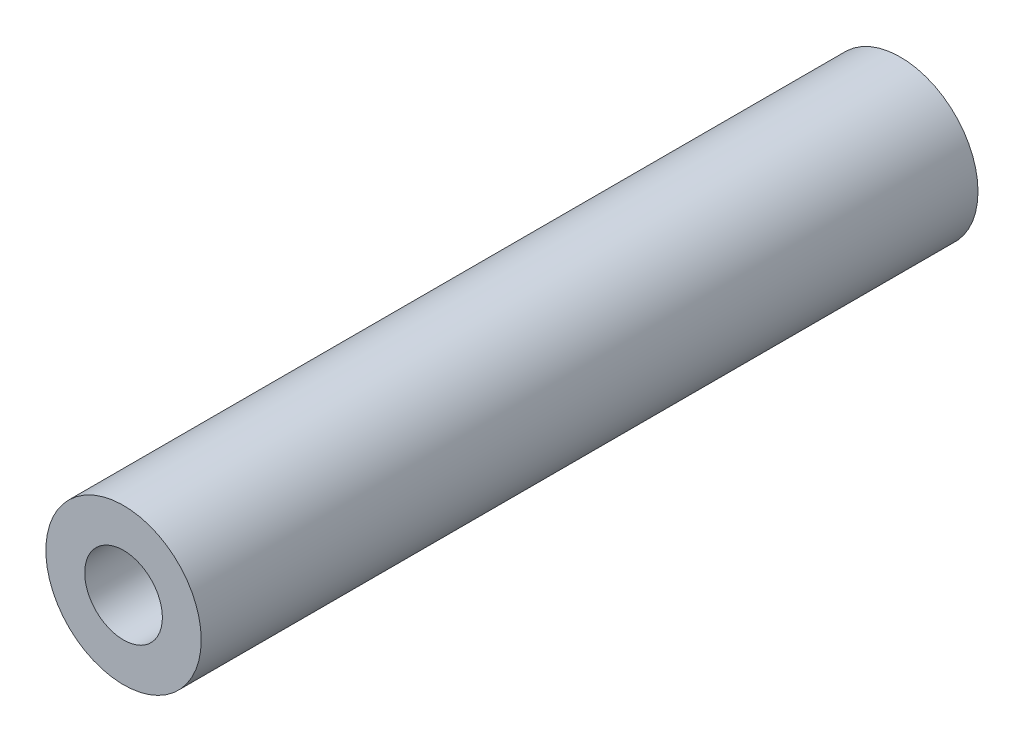
ISO-10303-21;
HEADER;
FILE_DESCRIPTION(('STEP AP214'),'2;1');
FILE_NAME('part.step','',(''),(''),'','','');
FILE_SCHEMA(('AUTOMOTIVE_DESIGN { 1 0 10303 214 1 1 1 1 }'));
ENDSEC;
DATA;
#1=APPLICATION_CONTEXT('core data for automotive mechanical design processes');
#2=APPLICATION_PROTOCOL_DEFINITION('international standard','automotive_design',2000,#1);
#3=PRODUCT_CONTEXT('',#1,'mechanical');
#4=PRODUCT('Part','Part','',(#3));
#5=PRODUCT_RELATED_PRODUCT_CATEGORY('part','',(#4));
#6=PRODUCT_DEFINITION_FORMATION('','',#4);
#7=PRODUCT_DEFINITION_CONTEXT('part definition',#1,'design');
#8=PRODUCT_DEFINITION('design','',#6,#7);
#9=PRODUCT_DEFINITION_SHAPE('','',#8);
#10=(LENGTH_UNIT() NAMED_UNIT(*) SI_UNIT(.MILLI.,.METRE.));
#11=(NAMED_UNIT(*) PLANE_ANGLE_UNIT() SI_UNIT($,.RADIAN.));
#12=(NAMED_UNIT(*) SI_UNIT($,.STERADIAN.) SOLID_ANGLE_UNIT());
#13=UNCERTAINTY_MEASURE_WITH_UNIT(LENGTH_MEASURE(1.E-05),#10,'distance_accuracy_value','');
#14=(GEOMETRIC_REPRESENTATION_CONTEXT(3) GLOBAL_UNCERTAINTY_ASSIGNED_CONTEXT((#13)) GLOBAL_UNIT_ASSIGNED_CONTEXT((#10,
#11,#12)) REPRESENTATION_CONTEXT('',''));
#15=CARTESIAN_POINT('',(0.,0.,0.));
#16=DIRECTION('',(0.,0.,1.));
#17=DIRECTION('',(1.,0.,0.));
#18=AXIS2_PLACEMENT_3D('',#15,#16,#17);
#19=CARTESIAN_POINT('',(0.,0.,20.));
#20=DIRECTION('',(0.,0.,1.));
#21=DIRECTION('',(1.,0.,0.));
#22=AXIS2_PLACEMENT_3D('',#19,#20,#21);
#23=PLANE('',#22);
#24=CARTESIAN_POINT('',(0.,0.,20.));
#25=DIRECTION('',(0.,0.,1.));
#26=DIRECTION('',(1.,0.,0.));
#27=AXIS2_PLACEMENT_3D('',#24,#25,#26);
#28=CIRCLE('',#27,2.);
#29=CARTESIAN_POINT('',(2.,0.,20.));
#30=VERTEX_POINT('',#29);
#31=EDGE_CURVE('E10',#30,#30,#28,.T.);
#32=ORIENTED_EDGE('',*,*,#31,.T.);
#33=EDGE_LOOP('',(#32));
#34=FACE_BOUND('',#33,.T.);
#35=CARTESIAN_POINT('',(0.,0.,20.));
#36=DIRECTION('',(0.,0.,1.));
#37=DIRECTION('',(1.,0.,0.));
#38=AXIS2_PLACEMENT_3D('',#35,#36,#37);
#39=CIRCLE('',#38,1.);
#40=CARTESIAN_POINT('',(1.,0.,20.));
#41=VERTEX_POINT('',#40);
#42=EDGE_CURVE('E46',#41,#41,#39,.T.);
#43=ORIENTED_EDGE('',*,*,#42,.F.);
#44=EDGE_LOOP('',(#43));
#45=FACE_BOUND('',#44,.T.);
#46=ADVANCED_FACE('F35',(#34,#45),#23,.T.);
#47=CARTESIAN_POINT('',(0.,0.,0.));
#48=DIRECTION('',(0.,0.,1.));
#49=DIRECTION('',(1.,0.,0.));
#50=AXIS2_PLACEMENT_3D('',#47,#48,#49);
#51=PLANE('',#50);
#52=CARTESIAN_POINT('',(0.,0.,0.));
#53=DIRECTION('',(0.,0.,1.));
#54=DIRECTION('',(1.,0.,0.));
#55=AXIS2_PLACEMENT_3D('',#52,#53,#54);
#56=CIRCLE('',#55,2.);
#57=CARTESIAN_POINT('',(2.,0.,0.));
#58=VERTEX_POINT('',#57);
#59=EDGE_CURVE('E39',#58,#58,#56,.T.);
#60=ORIENTED_EDGE('',*,*,#59,.F.);
#61=EDGE_LOOP('',(#60));
#62=FACE_BOUND('',#61,.T.);
#63=CARTESIAN_POINT('',(0.,0.,0.));
#64=DIRECTION('',(0.,0.,1.));
#65=DIRECTION('',(1.,0.,0.));
#66=AXIS2_PLACEMENT_3D('',#63,#64,#65);
#67=CIRCLE('',#66,1.);
#68=CARTESIAN_POINT('',(1.,0.,0.));
#69=VERTEX_POINT('',#68);
#70=EDGE_CURVE('E48',#69,#69,#67,.T.);
#71=ORIENTED_EDGE('',*,*,#70,.T.);
#72=EDGE_LOOP('',(#71));
#73=FACE_BOUND('',#72,.T.);
#74=ADVANCED_FACE('F58',(#62,#73),#51,.F.);
#75=CARTESIAN_POINT('',(0.,0.,20.));
#76=DIRECTION('',(0.,0.,-1.));
#77=DIRECTION('',(-1.,0.,0.));
#78=AXIS2_PLACEMENT_3D('',#75,#76,#77);
#79=CYLINDRICAL_SURFACE('',#78,2.);
#80=ORIENTED_EDGE('',*,*,#31,.F.);
#81=EDGE_LOOP('',(#80));
#82=FACE_BOUND('',#81,.T.);
#83=ORIENTED_EDGE('',*,*,#59,.T.);
#84=EDGE_LOOP('',(#83));
#85=FACE_BOUND('',#84,.T.);
#86=ADVANCED_FACE('F37',(#82,#85),#79,.T.);
#87=CARTESIAN_POINT('',(0.,0.,20.));
#88=DIRECTION('',(0.,0.,-1.));
#89=DIRECTION('',(-1.,0.,0.));
#90=AXIS2_PLACEMENT_3D('',#87,#88,#89);
#91=CYLINDRICAL_SURFACE('',#90,1.);
#92=ORIENTED_EDGE('',*,*,#42,.T.);
#93=EDGE_LOOP('',(#92));
#94=FACE_BOUND('',#93,.T.);
#95=ORIENTED_EDGE('',*,*,#70,.F.);
#96=EDGE_LOOP('',(#95));
#97=FACE_BOUND('',#96,.T.);
#98=ADVANCED_FACE('F54',(#94,#97),#91,.F.);
#99=CLOSED_SHELL('',(#46,#74,#86,#98));
#100=MANIFOLD_SOLID_BREP('B2',#99);
#101=ADVANCED_BREP_SHAPE_REPRESENTATION('',(#18,#100),#14);
#102=SHAPE_DEFINITION_REPRESENTATION(#9,#101);
ENDSEC;
END-ISO-10303-21;
